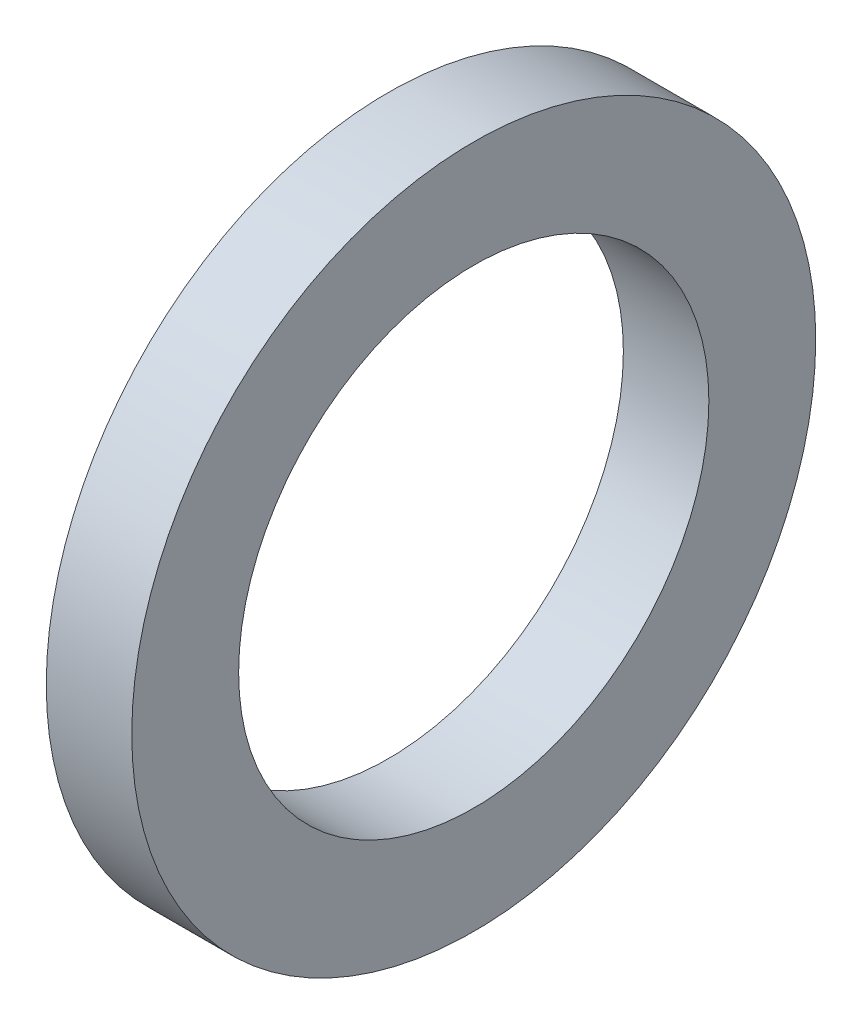
ISO-10303-21;
HEADER;
FILE_DESCRIPTION(('STEP AP214'),'2;1');
FILE_NAME('part.step','',(''),(''),'','','');
FILE_SCHEMA(('AUTOMOTIVE_DESIGN { 1 0 10303 214 1 1 1 1 }'));
ENDSEC;
DATA;
#1=APPLICATION_CONTEXT('core data for automotive mechanical design processes');
#2=APPLICATION_PROTOCOL_DEFINITION('international standard','automotive_design',2000,#1);
#3=PRODUCT_CONTEXT('',#1,'mechanical');
#4=PRODUCT('Part','Part','',(#3));
#5=PRODUCT_RELATED_PRODUCT_CATEGORY('part','',(#4));
#6=PRODUCT_DEFINITION_FORMATION('','',#4);
#7=PRODUCT_DEFINITION_CONTEXT('part definition',#1,'design');
#8=PRODUCT_DEFINITION('design','',#6,#7);
#9=PRODUCT_DEFINITION_SHAPE('','',#8);
#10=(LENGTH_UNIT() NAMED_UNIT(*) SI_UNIT(.MILLI.,.METRE.));
#11=(NAMED_UNIT(*) PLANE_ANGLE_UNIT() SI_UNIT($,.RADIAN.));
#12=(NAMED_UNIT(*) SI_UNIT($,.STERADIAN.) SOLID_ANGLE_UNIT());
#13=UNCERTAINTY_MEASURE_WITH_UNIT(LENGTH_MEASURE(1.E-05),#10,'distance_accuracy_value','');
#14=(GEOMETRIC_REPRESENTATION_CONTEXT(3) GLOBAL_UNCERTAINTY_ASSIGNED_CONTEXT((#13)) GLOBAL_UNIT_ASSIGNED_CONTEXT((#10,
#11,#12)) REPRESENTATION_CONTEXT('',''));
#15=CARTESIAN_POINT('',(0.,0.,0.));
#16=DIRECTION('',(0.,0.,1.));
#17=DIRECTION('',(1.,0.,0.));
#18=AXIS2_PLACEMENT_3D('',#15,#16,#17);
#19=CARTESIAN_POINT('',(-87.1403432374613,-55.,0.));
#20=DIRECTION('',(-1.,0.,0.));
#21=DIRECTION('',(0.,0.,1.));
#22=AXIS2_PLACEMENT_3D('',#19,#20,#21);
#23=CYLINDRICAL_SURFACE('',#22,55.);
#24=CARTESIAN_POINT('',(0.,-55.,0.));
#25=DIRECTION('',(-1.,0.,0.));
#26=DIRECTION('',(0.,0.,1.));
#27=AXIS2_PLACEMENT_3D('',#24,#25,#26);
#28=CIRCLE('',#27,55.);
#29=CARTESIAN_POINT('',(0.,-55.,55.));
#30=VERTEX_POINT('',#29);
#31=EDGE_CURVE('E46',#30,#30,#28,.T.);
#32=ORIENTED_EDGE('',*,*,#31,.T.);
#33=EDGE_LOOP('',(#32));
#34=FACE_BOUND('',#33,.T.);
#35=CARTESIAN_POINT('',(20.,-55.,0.));
#36=DIRECTION('',(-1.,0.,0.));
#37=DIRECTION('',(0.,0.,1.));
#38=AXIS2_PLACEMENT_3D('',#35,#36,#37);
#39=CIRCLE('',#38,55.);
#40=CARTESIAN_POINT('',(20.,-55.,55.));
#41=VERTEX_POINT('',#40);
#42=EDGE_CURVE('E10',#41,#41,#39,.T.);
#43=ORIENTED_EDGE('',*,*,#42,.F.);
#44=EDGE_LOOP('',(#43));
#45=FACE_BOUND('',#44,.T.);
#46=ADVANCED_FACE('F32',(#34,#45),#23,.F.);
#47=CARTESIAN_POINT('',(20.,0.,0.));
#48=DIRECTION('',(1.,0.,0.));
#49=DIRECTION('',(0.,0.,-1.));
#50=AXIS2_PLACEMENT_3D('',#47,#48,#49);
#51=PLANE('',#50);
#52=ORIENTED_EDGE('',*,*,#42,.T.);
#53=EDGE_LOOP('',(#52));
#54=FACE_BOUND('',#53,.T.);
#55=CARTESIAN_POINT('',(20.,-55.,0.));
#56=DIRECTION('',(-1.,0.,0.));
#57=DIRECTION('',(0.,0.,1.));
#58=AXIS2_PLACEMENT_3D('',#55,#56,#57);
#59=CIRCLE('',#58,80.);
#60=CARTESIAN_POINT('',(20.,-55.,80.));
#61=VERTEX_POINT('',#60);
#62=EDGE_CURVE('E38',#61,#61,#59,.T.);
#63=ORIENTED_EDGE('',*,*,#62,.F.);
#64=EDGE_LOOP('',(#63));
#65=FACE_BOUND('',#64,.T.);
#66=ADVANCED_FACE('F62',(#54,#65),#51,.T.);
#67=CARTESIAN_POINT('',(-87.1403432374613,-55.,0.));
#68=DIRECTION('',(-1.,0.,0.));
#69=DIRECTION('',(0.,0.,1.));
#70=AXIS2_PLACEMENT_3D('',#67,#68,#69);
#71=CYLINDRICAL_SURFACE('',#70,80.);
#72=ORIENTED_EDGE('',*,*,#62,.T.);
#73=EDGE_LOOP('',(#72));
#74=FACE_BOUND('',#73,.T.);
#75=CARTESIAN_POINT('',(0.,-55.,0.));
#76=DIRECTION('',(-1.,0.,0.));
#77=DIRECTION('',(0.,0.,1.));
#78=AXIS2_PLACEMENT_3D('',#75,#76,#77);
#79=CIRCLE('',#78,80.);
#80=CARTESIAN_POINT('',(0.,-55.,80.));
#81=VERTEX_POINT('',#80);
#82=EDGE_CURVE('E42',#81,#81,#79,.T.);
#83=ORIENTED_EDGE('',*,*,#82,.F.);
#84=EDGE_LOOP('',(#83));
#85=FACE_BOUND('',#84,.T.);
#86=ADVANCED_FACE('F56',(#74,#85),#71,.T.);
#87=CARTESIAN_POINT('',(0.,0.,0.));
#88=DIRECTION('',(-1.,0.,0.));
#89=DIRECTION('',(0.,0.,1.));
#90=AXIS2_PLACEMENT_3D('',#87,#88,#89);
#91=PLANE('',#90);
#92=ORIENTED_EDGE('',*,*,#82,.T.);
#93=EDGE_LOOP('',(#92));
#94=FACE_BOUND('',#93,.T.);
#95=ORIENTED_EDGE('',*,*,#31,.F.);
#96=EDGE_LOOP('',(#95));
#97=FACE_BOUND('',#96,.T.);
#98=ADVANCED_FACE('F54',(#94,#97),#91,.T.);
#99=CLOSED_SHELL('',(#46,#66,#86,#98));
#100=MANIFOLD_SOLID_BREP('B2',#99);
#101=ADVANCED_BREP_SHAPE_REPRESENTATION('',(#18,#100),#14);
#102=SHAPE_DEFINITION_REPRESENTATION(#9,#101);
ENDSEC;
END-ISO-10303-21;
